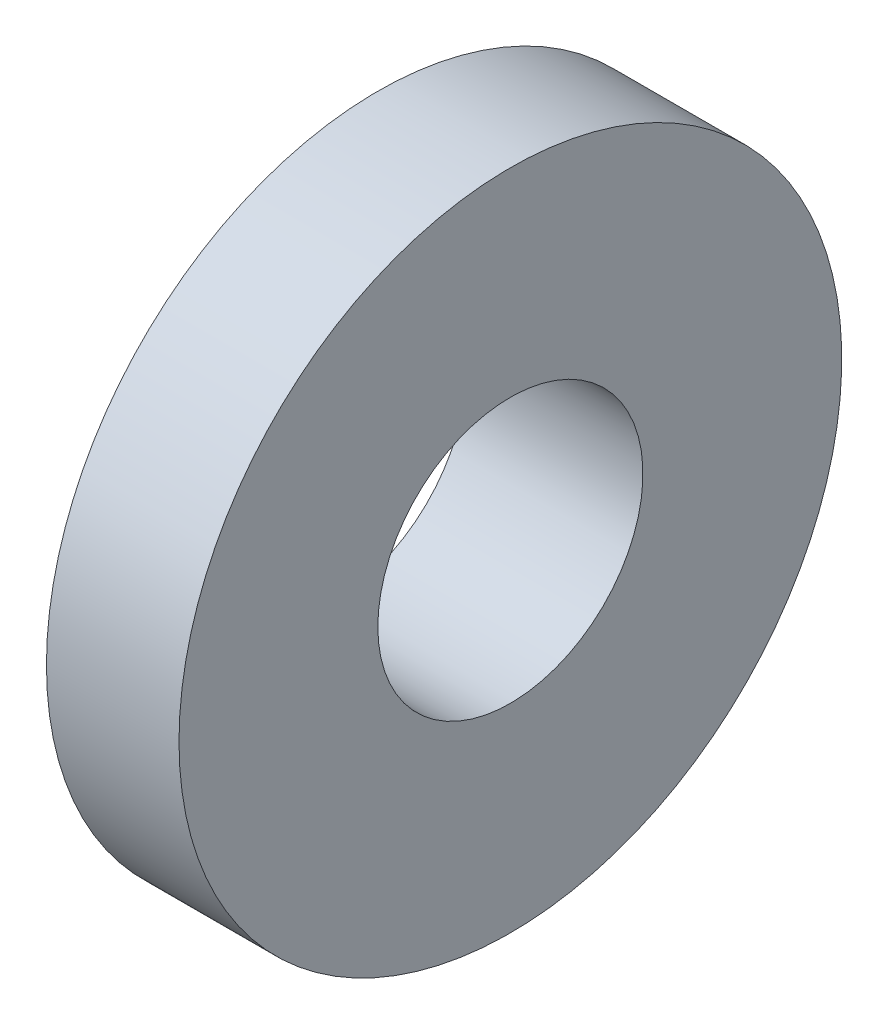
ISO-10303-21;
HEADER;
FILE_DESCRIPTION(('STEP AP214'),'2;1');
FILE_NAME('part.step','',(''),(''),'','','');
FILE_SCHEMA(('AUTOMOTIVE_DESIGN { 1 0 10303 214 1 1 1 1 }'));
ENDSEC;
DATA;
#1=APPLICATION_CONTEXT('core data for automotive mechanical design processes');
#2=APPLICATION_PROTOCOL_DEFINITION('international standard','automotive_design',2000,#1);
#3=PRODUCT_CONTEXT('',#1,'mechanical');
#4=PRODUCT('Part','Part','',(#3));
#5=PRODUCT_RELATED_PRODUCT_CATEGORY('part','',(#4));
#6=PRODUCT_DEFINITION_FORMATION('','',#4);
#7=PRODUCT_DEFINITION_CONTEXT('part definition',#1,'design');
#8=PRODUCT_DEFINITION('design','',#6,#7);
#9=PRODUCT_DEFINITION_SHAPE('','',#8);
#10=(LENGTH_UNIT() NAMED_UNIT(*) SI_UNIT(.MILLI.,.METRE.));
#11=(NAMED_UNIT(*) PLANE_ANGLE_UNIT() SI_UNIT($,.RADIAN.));
#12=(NAMED_UNIT(*) SI_UNIT($,.STERADIAN.) SOLID_ANGLE_UNIT());
#13=UNCERTAINTY_MEASURE_WITH_UNIT(LENGTH_MEASURE(1.E-05),#10,'distance_accuracy_value','');
#14=(GEOMETRIC_REPRESENTATION_CONTEXT(3) GLOBAL_UNCERTAINTY_ASSIGNED_CONTEXT((#13)) GLOBAL_UNIT_ASSIGNED_CONTEXT((#10,
#11,#12)) REPRESENTATION_CONTEXT('',''));
#15=CARTESIAN_POINT('',(0.,0.,0.));
#16=DIRECTION('',(0.,0.,1.));
#17=DIRECTION('',(1.,0.,0.));
#18=AXIS2_PLACEMENT_3D('',#15,#16,#17);
#19=CARTESIAN_POINT('',(-0.804001584786054,0.,0.));
#20=DIRECTION('',(-1.,0.,0.));
#21=DIRECTION('',(0.,0.,1.));
#22=AXIS2_PLACEMENT_3D('',#19,#20,#21);
#23=CYLINDRICAL_SURFACE('',#22,2.55);
#24=CARTESIAN_POINT('',(2.59599841521395,0.,0.));
#25=DIRECTION('',(-1.,0.,0.));
#26=DIRECTION('',(0.,0.,1.));
#27=AXIS2_PLACEMENT_3D('',#24,#25,#26);
#28=CIRCLE('',#27,2.55);
#29=CARTESIAN_POINT('',(2.59599841521395,0.,2.55));
#30=VERTEX_POINT('',#29);
#31=EDGE_CURVE('E55',#30,#30,#28,.T.);
#32=ORIENTED_EDGE('',*,*,#31,.F.);
#33=EDGE_LOOP('',(#32));
#34=FACE_BOUND('',#33,.T.);
#35=CARTESIAN_POINT('',(-0.804001584786054,0.,0.));
#36=DIRECTION('',(-1.,0.,0.));
#37=DIRECTION('',(0.,0.,1.));
#38=AXIS2_PLACEMENT_3D('',#35,#36,#37);
#39=CIRCLE('',#38,2.55);
#40=CARTESIAN_POINT('',(-0.804001584786054,0.,2.55));
#41=VERTEX_POINT('',#40);
#42=EDGE_CURVE('E10',#41,#41,#39,.T.);
#43=ORIENTED_EDGE('',*,*,#42,.T.);
#44=EDGE_LOOP('',(#43));
#45=FACE_BOUND('',#44,.T.);
#46=ADVANCED_FACE('F33',(#34,#45),#23,.F.);
#47=CARTESIAN_POINT('',(-0.804001584786054,2.55,0.));
#48=DIRECTION('',(1.,0.,0.));
#49=DIRECTION('',(0.,0.,-1.));
#50=AXIS2_PLACEMENT_3D('',#47,#48,#49);
#51=PLANE('',#50);
#52=ORIENTED_EDGE('',*,*,#42,.F.);
#53=EDGE_LOOP('',(#52));
#54=FACE_BOUND('',#53,.T.);
#55=CARTESIAN_POINT('',(-0.804001584786054,0.,0.));
#56=DIRECTION('',(-1.,0.,0.));
#57=DIRECTION('',(0.,0.,1.));
#58=AXIS2_PLACEMENT_3D('',#55,#56,#57);
#59=CIRCLE('',#58,4.25);
#60=CARTESIAN_POINT('',(-0.804001584786054,0.,4.25));
#61=VERTEX_POINT('',#60);
#62=EDGE_CURVE('E39',#61,#61,#59,.T.);
#63=ORIENTED_EDGE('',*,*,#62,.T.);
#64=EDGE_LOOP('',(#63));
#65=FACE_BOUND('',#64,.T.);
#66=ADVANCED_FACE('F62',(#54,#65),#51,.F.);
#67=CARTESIAN_POINT('',(-0.804001584786054,0.,0.));
#68=DIRECTION('',(-1.,0.,0.));
#69=DIRECTION('',(0.,0.,1.));
#70=AXIS2_PLACEMENT_3D('',#67,#68,#69);
#71=CYLINDRICAL_SURFACE('',#70,4.25);
#72=ORIENTED_EDGE('',*,*,#62,.F.);
#73=EDGE_LOOP('',(#72));
#74=FACE_BOUND('',#73,.T.);
#75=CARTESIAN_POINT('',(0.0459984152139461,0.,0.));
#76=DIRECTION('',(-1.,0.,0.));
#77=DIRECTION('',(0.,0.,1.));
#78=AXIS2_PLACEMENT_3D('',#75,#76,#77);
#79=CIRCLE('',#78,4.25);
#80=CARTESIAN_POINT('',(0.0459984152139461,0.,4.25));
#81=VERTEX_POINT('',#80);
#82=EDGE_CURVE('E43',#81,#81,#79,.T.);
#83=ORIENTED_EDGE('',*,*,#82,.T.);
#84=EDGE_LOOP('',(#83));
#85=FACE_BOUND('',#84,.T.);
#86=ADVANCED_FACE('F66',(#74,#85),#71,.T.);
#87=CARTESIAN_POINT('',(0.0459984152139461,4.25,0.));
#88=DIRECTION('',(1.,0.,0.));
#89=DIRECTION('',(0.,0.,-1.));
#90=AXIS2_PLACEMENT_3D('',#87,#88,#89);
#91=PLANE('',#90);
#92=ORIENTED_EDGE('',*,*,#82,.F.);
#93=EDGE_LOOP('',(#92));
#94=FACE_BOUND('',#93,.T.);
#95=CARTESIAN_POINT('',(0.0459984152139461,0.,0.));
#96=DIRECTION('',(-1.,0.,0.));
#97=DIRECTION('',(0.,0.,1.));
#98=AXIS2_PLACEMENT_3D('',#95,#96,#97);
#99=CIRCLE('',#98,6.375);
#100=CARTESIAN_POINT('',(0.0459984152139461,0.,6.375));
#101=VERTEX_POINT('',#100);
#102=EDGE_CURVE('E47',#101,#101,#99,.T.);
#103=ORIENTED_EDGE('',*,*,#102,.T.);
#104=EDGE_LOOP('',(#103));
#105=FACE_BOUND('',#104,.T.);
#106=ADVANCED_FACE('F71',(#94,#105),#91,.F.);
#107=CARTESIAN_POINT('',(-0.804001584786054,0.,0.));
#108=DIRECTION('',(-1.,0.,0.));
#109=DIRECTION('',(0.,0.,1.));
#110=AXIS2_PLACEMENT_3D('',#107,#108,#109);
#111=CYLINDRICAL_SURFACE('',#110,6.375);
#112=ORIENTED_EDGE('',*,*,#102,.F.);
#113=EDGE_LOOP('',(#112));
#114=FACE_BOUND('',#113,.T.);
#115=CARTESIAN_POINT('',(2.59599841521395,0.,0.));
#116=DIRECTION('',(-1.,0.,0.));
#117=DIRECTION('',(0.,0.,1.));
#118=AXIS2_PLACEMENT_3D('',#115,#116,#117);
#119=CIRCLE('',#118,6.375);
#120=CARTESIAN_POINT('',(2.59599841521395,0.,6.375));
#121=VERTEX_POINT('',#120);
#122=EDGE_CURVE('E52',#121,#121,#119,.T.);
#123=ORIENTED_EDGE('',*,*,#122,.T.);
#124=EDGE_LOOP('',(#123));
#125=FACE_BOUND('',#124,.T.);
#126=ADVANCED_FACE('F77',(#114,#125),#111,.T.);
#127=CARTESIAN_POINT('',(2.59599841521395,6.375,0.));
#128=DIRECTION('',(-1.,0.,0.));
#129=DIRECTION('',(0.,0.,1.));
#130=AXIS2_PLACEMENT_3D('',#127,#128,#129);
#131=PLANE('',#130);
#132=ORIENTED_EDGE('',*,*,#122,.F.);
#133=EDGE_LOOP('',(#132));
#134=FACE_BOUND('',#133,.T.);
#135=ORIENTED_EDGE('',*,*,#31,.T.);
#136=EDGE_LOOP('',(#135));
#137=FACE_BOUND('',#136,.T.);
#138=ADVANCED_FACE('F59',(#134,#137),#131,.F.);
#139=CLOSED_SHELL('',(#46,#66,#86,#106,#126,#138));
#140=MANIFOLD_SOLID_BREP('B2',#139);
#141=ADVANCED_BREP_SHAPE_REPRESENTATION('',(#18,#140),#14);
#142=SHAPE_DEFINITION_REPRESENTATION(#9,#141);
ENDSEC;
END-ISO-10303-21;
